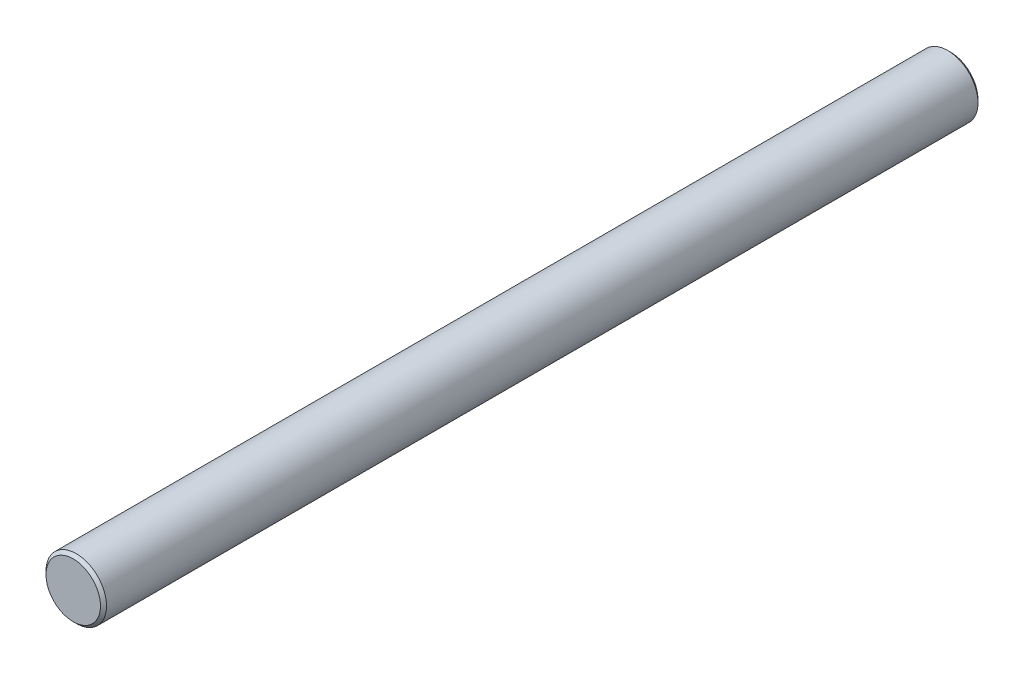
ISO-10303-21;
HEADER;
FILE_DESCRIPTION(('STEP AP214'),'2;1');
FILE_NAME('part.step','',(''),(''),'','','');
FILE_SCHEMA(('AUTOMOTIVE_DESIGN { 1 0 10303 214 1 1 1 1 }'));
ENDSEC;
DATA;
#1=APPLICATION_CONTEXT('core data for automotive mechanical design processes');
#2=APPLICATION_PROTOCOL_DEFINITION('international standard','automotive_design',2000,#1);
#3=PRODUCT_CONTEXT('',#1,'mechanical');
#4=PRODUCT('Part','Part','',(#3));
#5=PRODUCT_RELATED_PRODUCT_CATEGORY('part','',(#4));
#6=PRODUCT_DEFINITION_FORMATION('','',#4);
#7=PRODUCT_DEFINITION_CONTEXT('part definition',#1,'design');
#8=PRODUCT_DEFINITION('design','',#6,#7);
#9=PRODUCT_DEFINITION_SHAPE('','',#8);
#10=(LENGTH_UNIT() NAMED_UNIT(*) SI_UNIT(.MILLI.,.METRE.));
#11=(NAMED_UNIT(*) PLANE_ANGLE_UNIT() SI_UNIT($,.RADIAN.));
#12=(NAMED_UNIT(*) SI_UNIT($,.STERADIAN.) SOLID_ANGLE_UNIT());
#13=UNCERTAINTY_MEASURE_WITH_UNIT(LENGTH_MEASURE(1.E-05),#10,'distance_accuracy_value','');
#14=(GEOMETRIC_REPRESENTATION_CONTEXT(3) GLOBAL_UNCERTAINTY_ASSIGNED_CONTEXT((#13)) GLOBAL_UNIT_ASSIGNED_CONTEXT((#10,
#11,#12)) REPRESENTATION_CONTEXT('',''));
#15=CARTESIAN_POINT('',(0.,0.,0.));
#16=DIRECTION('',(0.,0.,1.));
#17=DIRECTION('',(1.,0.,0.));
#18=AXIS2_PLACEMENT_3D('',#15,#16,#17);
#19=CARTESIAN_POINT('',(0.,0.,145.));
#20=DIRECTION('',(0.,0.,-1.));
#21=DIRECTION('',(-1.,0.,0.));
#22=AXIS2_PLACEMENT_3D('',#19,#20,#21);
#23=CYLINDRICAL_SURFACE('',#22,5.);
#24=CARTESIAN_POINT('',(0.,0.,144.5));
#25=DIRECTION('',(0.,0.,1.));
#26=DIRECTION('',(1.,0.,0.));
#27=AXIS2_PLACEMENT_3D('',#24,#25,#26);
#28=CIRCLE('',#27,5.);
#29=CARTESIAN_POINT('',(5.,0.,144.5));
#30=VERTEX_POINT('',#29);
#31=EDGE_CURVE('E90',#30,#30,#28,.F.);
#32=ORIENTED_EDGE('',*,*,#31,.T.);
#33=EDGE_LOOP('',(#32));
#34=FACE_BOUND('',#33,.T.);
#35=DIRECTION('',(0.,0.,-1.));
#36=VECTOR('',#35,1.);
#37=CARTESIAN_POINT('',(-4.,-3.,8.));
#38=LINE('',#37,#36);
#39=CARTESIAN_POINT('',(-4.,-3.,8.));
#40=VERTEX_POINT('',#39);
#41=CARTESIAN_POINT('',(-4.,-3.,0.499999999999973));
#42=VERTEX_POINT('',#41);
#43=EDGE_CURVE('E77',#40,#42,#38,.T.);
#44=ORIENTED_EDGE('',*,*,#43,.T.);
#45=CARTESIAN_POINT('',(0.,0.,0.499999999999973));
#46=DIRECTION('',(0.,0.,1.));
#47=DIRECTION('',(1.,0.,0.));
#48=AXIS2_PLACEMENT_3D('',#45,#46,#47);
#49=CIRCLE('',#48,5.);
#50=CARTESIAN_POINT('',(-4.,3.,0.499999999999973));
#51=VERTEX_POINT('',#50);
#52=EDGE_CURVE('E81',#42,#51,#49,.T.);
#53=ORIENTED_EDGE('',*,*,#52,.T.);
#54=DIRECTION('',(0.,0.,-1.));
#55=VECTOR('',#54,1.);
#56=CARTESIAN_POINT('',(-4.,3.,8.));
#57=LINE('',#56,#55);
#58=CARTESIAN_POINT('',(-4.,3.,8.));
#59=VERTEX_POINT('',#58);
#60=EDGE_CURVE('E76',#59,#51,#57,.T.);
#61=ORIENTED_EDGE('',*,*,#60,.F.);
#62=CARTESIAN_POINT('',(0.,0.,8.));
#63=DIRECTION('',(0.,0.,-1.));
#64=DIRECTION('',(-1.,0.,0.));
#65=AXIS2_PLACEMENT_3D('',#62,#63,#64);
#66=CIRCLE('',#65,5.);
#67=EDGE_CURVE('E66',#40,#59,#66,.T.);
#68=ORIENTED_EDGE('',*,*,#67,.F.);
#69=EDGE_LOOP('',(#44,#53,#61,#68));
#70=FACE_BOUND('',#69,.T.);
#71=ADVANCED_FACE('F33',(#34,#70),#23,.T.);
#72=CARTESIAN_POINT('',(0.,0.,145.));
#73=DIRECTION('',(0.,0.,1.));
#74=DIRECTION('',(1.,0.,0.));
#75=AXIS2_PLACEMENT_3D('',#72,#73,#74);
#76=PLANE('',#75);
#77=CARTESIAN_POINT('',(0.,0.,145.));
#78=DIRECTION('',(0.,0.,1.));
#79=DIRECTION('',(1.,0.,0.));
#80=AXIS2_PLACEMENT_3D('',#77,#78,#79);
#81=CIRCLE('',#80,4.50000000000002);
#82=CARTESIAN_POINT('',(4.50000000000002,0.,145.));
#83=VERTEX_POINT('',#82);
#84=EDGE_CURVE('E83',#83,#83,#81,.T.);
#85=ORIENTED_EDGE('',*,*,#84,.T.);
#86=EDGE_LOOP('',(#85));
#87=FACE_BOUND('',#86,.T.);
#88=ADVANCED_FACE('F106',(#87),#76,.T.);
#89=CARTESIAN_POINT('',(0.,0.,0.));
#90=DIRECTION('',(0.,0.,1.));
#91=DIRECTION('',(1.,0.,0.));
#92=AXIS2_PLACEMENT_3D('',#89,#90,#91);
#93=PLANE('',#92);
#94=DIRECTION('',(0.,-1.,0.));
#95=VECTOR('',#94,1.);
#96=CARTESIAN_POINT('',(-4.,3.,0.));
#97=LINE('',#96,#95);
#98=CARTESIAN_POINT('',(-4.,2.06155281280887,0.));
#99=VERTEX_POINT('',#98);
#100=CARTESIAN_POINT('',(-4.,-2.06155281280887,0.));
#101=VERTEX_POINT('',#100);
#102=EDGE_CURVE('E73',#99,#101,#97,.T.);
#103=ORIENTED_EDGE('',*,*,#102,.F.);
#104=CARTESIAN_POINT('',(0.,0.,0.));
#105=DIRECTION('',(0.,0.,1.));
#106=DIRECTION('',(1.,0.,0.));
#107=AXIS2_PLACEMENT_3D('',#104,#105,#106);
#108=CIRCLE('',#107,4.50000000000002);
#109=EDGE_CURVE('E11',#99,#101,#108,.F.);
#110=ORIENTED_EDGE('',*,*,#109,.T.);
#111=EDGE_LOOP('',(#103,#110));
#112=FACE_BOUND('',#111,.T.);
#113=ADVANCED_FACE('F105',(#112),#93,.F.);
#114=CARTESIAN_POINT('',(-4.,3.,8.));
#115=DIRECTION('',(1.,0.,0.));
#116=DIRECTION('',(0.,0.,-1.));
#117=AXIS2_PLACEMENT_3D('',#114,#115,#116);
#118=PLANE('',#117);
#119=ORIENTED_EDGE('',*,*,#60,.T.);
#120=CARTESIAN_POINT('',(-4.,3.,0.499999999999973));
#121=CARTESIAN_POINT('',(-4.,2.92395437787625,0.454379153524644));
#122=CARTESIAN_POINT('',(-4.,2.84741921077895,0.4095619294171));
#123=CARTESIAN_POINT('',(-4.,2.69334289145611,0.321832867609854));
#124=CARTESIAN_POINT('',(-4.,2.61580254891196,0.278919606187147));
#125=CARTESIAN_POINT('',(-4.,2.45956360716284,0.195221073476591));
#126=CARTESIAN_POINT('',(-4.,2.38086486210246,0.154436073149661));
#127=CARTESIAN_POINT('',(-4.,2.22218014248443,0.0752997484458582));
#128=CARTESIAN_POINT('',(-4.,2.14219323284081,0.0369503020257225));
#129=CARTESIAN_POINT('',(-4.,2.06155281280887,0.));
#130=B_SPLINE_CURVE_WITH_KNOTS('',3,(#120,#121,#122,#123,#124,#125,#126,#127,#128,#129),
.UNSPECIFIED.,.F.,.F.,(4,2,2,2,4),(0.,0.266045107235559,0.53188780069481,0.79776425791918,
1.06384329320016),.UNSPECIFIED.);
#131=EDGE_CURVE('E42',#51,#99,#130,.T.);
#132=ORIENTED_EDGE('',*,*,#131,.T.);
#133=ORIENTED_EDGE('',*,*,#102,.T.);
#134=CARTESIAN_POINT('',(-4.,-2.06155281280887,0.));
#135=CARTESIAN_POINT('',(-4.,-2.14219323284081,0.0369503020257225));
#136=CARTESIAN_POINT('',(-4.,-2.22218014248443,0.0752997484458582));
#137=CARTESIAN_POINT('',(-4.,-2.38086486210246,0.154436073149661));
#138=CARTESIAN_POINT('',(-4.,-2.45956360716284,0.195221073476591));
#139=CARTESIAN_POINT('',(-4.,-2.61580254891196,0.278919606187147));
#140=CARTESIAN_POINT('',(-4.,-2.69334289145611,0.321832867609854));
#141=CARTESIAN_POINT('',(-4.,-2.84741921077896,0.4095619294171));
#142=CARTESIAN_POINT('',(-4.,-2.92395437787625,0.454379153524644));
#143=CARTESIAN_POINT('',(-4.,-3.,0.499999999999972));
#144=B_SPLINE_CURVE_WITH_KNOTS('',3,(#134,#135,#136,#137,#138,#139,#140,#141,#142,#143),
.UNSPECIFIED.,.F.,.F.,(4,2,2,2,4),(0.,0.266079035280982,0.531955492505352,0.797798185964604,
1.06384329320016),.UNSPECIFIED.);
#145=EDGE_CURVE('E93',#101,#42,#144,.T.);
#146=ORIENTED_EDGE('',*,*,#145,.T.);
#147=ORIENTED_EDGE('',*,*,#43,.F.);
#148=DIRECTION('',(0.,-1.,0.));
#149=VECTOR('',#148,1.);
#150=CARTESIAN_POINT('',(-4.,3.,8.));
#151=LINE('',#150,#149);
#152=EDGE_CURVE('E69',#59,#40,#151,.T.);
#153=ORIENTED_EDGE('',*,*,#152,.F.);
#154=EDGE_LOOP('',(#119,#132,#133,#146,#147,#153));
#155=FACE_BOUND('',#154,.T.);
#156=ADVANCED_FACE('F75',(#155),#118,.F.);
#157=CARTESIAN_POINT('',(0.,0.,8.));
#158=DIRECTION('',(0.,0.,-1.));
#159=DIRECTION('',(-1.,0.,0.));
#160=AXIS2_PLACEMENT_3D('',#157,#158,#159);
#161=PLANE('',#160);
#162=ORIENTED_EDGE('',*,*,#67,.T.);
#163=ORIENTED_EDGE('',*,*,#152,.T.);
#164=EDGE_LOOP('',(#162,#163));
#165=FACE_BOUND('',#164,.T.);
#166=ADVANCED_FACE('F68',(#165),#161,.T.);
#167=CARTESIAN_POINT('',(0.,0.,145.));
#168=DIRECTION('',(0.,0.,-1.));
#169=DIRECTION('',(-1.,0.,0.));
#170=AXIS2_PLACEMENT_3D('',#167,#168,#169);
#171=CONICAL_SURFACE('',#170,4.50000000000002,0.785398163397486);
#172=ORIENTED_EDGE('',*,*,#31,.F.);
#173=EDGE_LOOP('',(#172));
#174=FACE_BOUND('',#173,.T.);
#175=ORIENTED_EDGE('',*,*,#84,.F.);
#176=EDGE_LOOP('',(#175));
#177=FACE_BOUND('',#176,.T.);
#178=ADVANCED_FACE('F115',(#174,#177),#171,.T.);
#179=CARTESIAN_POINT('',(0.,0.,0.499999999999973));
#180=DIRECTION('',(0.,0.,1.));
#181=DIRECTION('',(1.,0.,0.));
#182=AXIS2_PLACEMENT_3D('',#179,#180,#181);
#183=CONICAL_SURFACE('',#182,5.,0.785398163397458);
#184=ORIENTED_EDGE('',*,*,#145,.F.);
#185=ORIENTED_EDGE('',*,*,#109,.F.);
#186=ORIENTED_EDGE('',*,*,#131,.F.);
#187=ORIENTED_EDGE('',*,*,#52,.F.);
#188=EDGE_LOOP('',(#184,#185,#186,#187));
#189=FACE_BOUND('',#188,.T.);
#190=ADVANCED_FACE('F35',(#189),#183,.T.);
#191=CLOSED_SHELL('',(#71,#88,#113,#156,#166,#178,#190));
#192=MANIFOLD_SOLID_BREP('B2',#191);
#193=ADVANCED_BREP_SHAPE_REPRESENTATION('',(#18,#192),#14);
#194=SHAPE_DEFINITION_REPRESENTATION(#9,#193);
ENDSEC;
END-ISO-10303-21;
